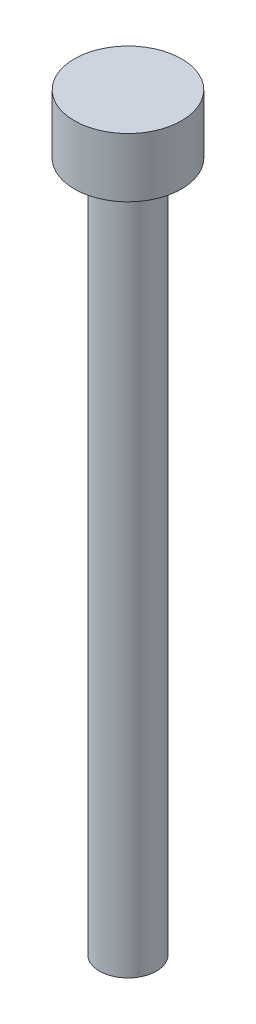
ISO-10303-21;
HEADER;
FILE_DESCRIPTION(('STEP AP214'),'2;1');
FILE_NAME('part.step','',(''),(''),'','','');
FILE_SCHEMA(('AUTOMOTIVE_DESIGN { 1 0 10303 214 1 1 1 1 }'));
ENDSEC;
DATA;
#1=APPLICATION_CONTEXT('core data for automotive mechanical design processes');
#2=APPLICATION_PROTOCOL_DEFINITION('international standard','automotive_design',2000,#1);
#3=PRODUCT_CONTEXT('',#1,'mechanical');
#4=PRODUCT('Part','Part','',(#3));
#5=PRODUCT_RELATED_PRODUCT_CATEGORY('part','',(#4));
#6=PRODUCT_DEFINITION_FORMATION('','',#4);
#7=PRODUCT_DEFINITION_CONTEXT('part definition',#1,'design');
#8=PRODUCT_DEFINITION('design','',#6,#7);
#9=PRODUCT_DEFINITION_SHAPE('','',#8);
#10=(LENGTH_UNIT() NAMED_UNIT(*) SI_UNIT(.MILLI.,.METRE.));
#11=(NAMED_UNIT(*) PLANE_ANGLE_UNIT() SI_UNIT($,.RADIAN.));
#12=(NAMED_UNIT(*) SI_UNIT($,.STERADIAN.) SOLID_ANGLE_UNIT());
#13=UNCERTAINTY_MEASURE_WITH_UNIT(LENGTH_MEASURE(1.E-05),#10,'distance_accuracy_value','');
#14=(GEOMETRIC_REPRESENTATION_CONTEXT(3) GLOBAL_UNCERTAINTY_ASSIGNED_CONTEXT((#13)) GLOBAL_UNIT_ASSIGNED_CONTEXT((#10,
#11,#12)) REPRESENTATION_CONTEXT('',''));
#15=CARTESIAN_POINT('',(0.,0.,0.));
#16=DIRECTION('',(0.,0.,1.));
#17=DIRECTION('',(1.,0.,0.));
#18=AXIS2_PLACEMENT_3D('',#15,#16,#17);
#19=CARTESIAN_POINT('',(0.,3.,0.));
#20=DIRECTION('',(0.,-1.,0.));
#21=DIRECTION('',(0.,0.,-1.));
#22=AXIS2_PLACEMENT_3D('',#19,#20,#21);
#23=CYLINDRICAL_SURFACE('',#22,2.72);
#24=CARTESIAN_POINT('',(0.,3.,0.));
#25=DIRECTION('',(0.,1.,0.));
#26=DIRECTION('',(0.,0.,1.));
#27=AXIS2_PLACEMENT_3D('',#24,#25,#26);
#28=CIRCLE('',#27,2.72);
#29=CARTESIAN_POINT('',(0.,3.,2.72));
#30=VERTEX_POINT('',#29);
#31=EDGE_CURVE('E45',#30,#30,#28,.T.);
#32=ORIENTED_EDGE('',*,*,#31,.F.);
#33=EDGE_LOOP('',(#32));
#34=FACE_BOUND('',#33,.T.);
#35=CARTESIAN_POINT('',(0.,0.,0.));
#36=DIRECTION('',(0.,1.,0.));
#37=DIRECTION('',(0.,0.,1.));
#38=AXIS2_PLACEMENT_3D('',#35,#36,#37);
#39=CIRCLE('',#38,2.72);
#40=CARTESIAN_POINT('',(0.,0.,2.72));
#41=VERTEX_POINT('',#40);
#42=EDGE_CURVE('E40',#41,#41,#39,.T.);
#43=ORIENTED_EDGE('',*,*,#42,.T.);
#44=EDGE_LOOP('',(#43));
#45=FACE_BOUND('',#44,.T.);
#46=ADVANCED_FACE('F37',(#34,#45),#23,.T.);
#47=CARTESIAN_POINT('',(0.,3.,0.));
#48=DIRECTION('',(0.,1.,0.));
#49=DIRECTION('',(0.,0.,1.));
#50=AXIS2_PLACEMENT_3D('',#47,#48,#49);
#51=PLANE('',#50);
#52=ORIENTED_EDGE('',*,*,#31,.T.);
#53=EDGE_LOOP('',(#52));
#54=FACE_BOUND('',#53,.T.);
#55=ADVANCED_FACE('F65',(#54),#51,.T.);
#56=CARTESIAN_POINT('',(0.,0.,0.));
#57=DIRECTION('',(0.,1.,0.));
#58=DIRECTION('',(0.,0.,1.));
#59=AXIS2_PLACEMENT_3D('',#56,#57,#58);
#60=PLANE('',#59);
#61=CARTESIAN_POINT('',(0.,0.,0.));
#62=DIRECTION('',(0.,-1.,0.));
#63=DIRECTION('',(0.,0.,-1.));
#64=AXIS2_PLACEMENT_3D('',#61,#62,#63);
#65=CIRCLE('',#64,1.44);
#66=CARTESIAN_POINT('',(0.,0.,-1.44));
#67=VERTEX_POINT('',#66);
#68=EDGE_CURVE('E10',#67,#67,#65,.T.);
#69=ORIENTED_EDGE('',*,*,#68,.F.);
#70=EDGE_LOOP('',(#69));
#71=FACE_BOUND('',#70,.T.);
#72=ORIENTED_EDGE('',*,*,#42,.F.);
#73=EDGE_LOOP('',(#72));
#74=FACE_BOUND('',#73,.T.);
#75=ADVANCED_FACE('F62',(#71,#74),#60,.F.);
#76=CARTESIAN_POINT('',(0.,-35.,0.));
#77=DIRECTION('',(0.,1.,0.));
#78=DIRECTION('',(0.,0.,1.));
#79=AXIS2_PLACEMENT_3D('',#76,#77,#78);
#80=CYLINDRICAL_SURFACE('',#79,1.44);
#81=CARTESIAN_POINT('',(0.,-35.,0.));
#82=DIRECTION('',(0.,-1.,0.));
#83=DIRECTION('',(0.,0.,-1.));
#84=AXIS2_PLACEMENT_3D('',#81,#82,#83);
#85=CIRCLE('',#84,1.44);
#86=CARTESIAN_POINT('',(0.,-35.,-1.44));
#87=VERTEX_POINT('',#86);
#88=EDGE_CURVE('E52',#87,#87,#85,.T.);
#89=ORIENTED_EDGE('',*,*,#88,.F.);
#90=EDGE_LOOP('',(#89));
#91=FACE_BOUND('',#90,.T.);
#92=ORIENTED_EDGE('',*,*,#68,.T.);
#93=EDGE_LOOP('',(#92));
#94=FACE_BOUND('',#93,.T.);
#95=ADVANCED_FACE('F64',(#91,#94),#80,.T.);
#96=CARTESIAN_POINT('',(0.,-35.,0.));
#97=DIRECTION('',(0.,-1.,0.));
#98=DIRECTION('',(0.,0.,-1.));
#99=AXIS2_PLACEMENT_3D('',#96,#97,#98);
#100=PLANE('',#99);
#101=ORIENTED_EDGE('',*,*,#88,.T.);
#102=EDGE_LOOP('',(#101));
#103=FACE_BOUND('',#102,.T.);
#104=ADVANCED_FACE('F71',(#103),#100,.T.);
#105=CLOSED_SHELL('',(#46,#55,#75,#95,#104));
#106=MANIFOLD_SOLID_BREP('B2',#105);
#107=ADVANCED_BREP_SHAPE_REPRESENTATION('',(#18,#106),#14);
#108=SHAPE_DEFINITION_REPRESENTATION(#9,#107);
ENDSEC;
END-ISO-10303-21;
